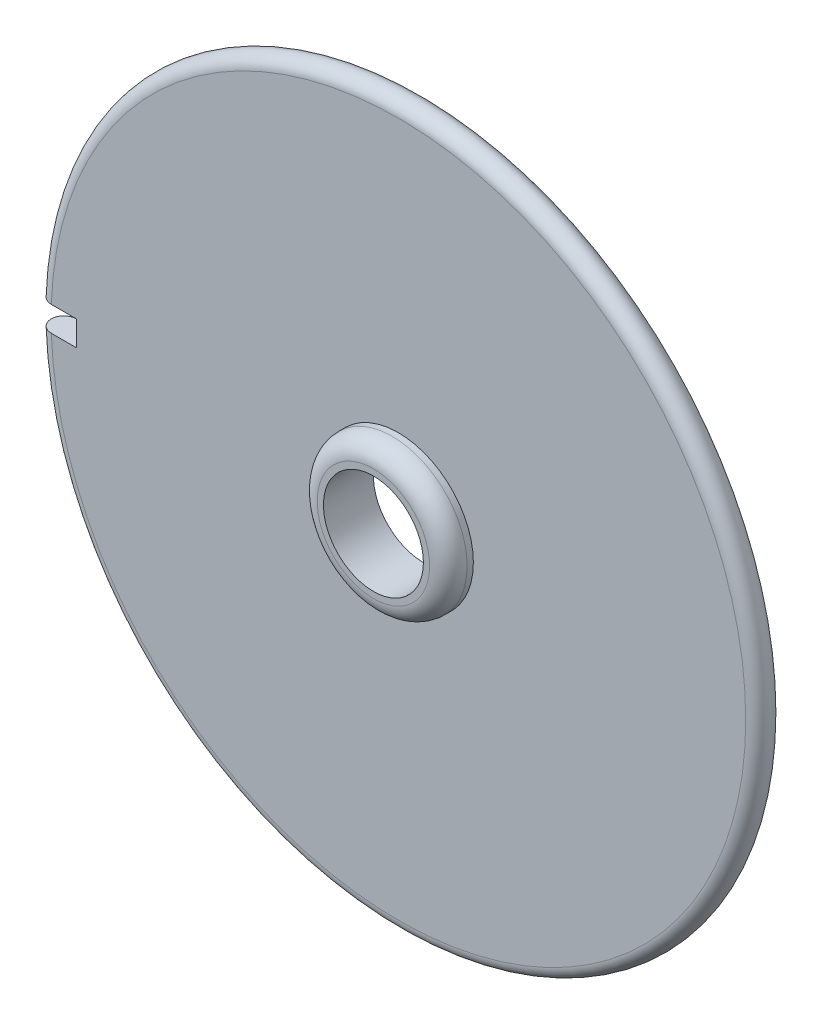
ISO-10303-21;
HEADER;
FILE_DESCRIPTION(('STEP AP214'),'2;1');
FILE_NAME('part.step','',(''),(''),'','','');
FILE_SCHEMA(('AUTOMOTIVE_DESIGN { 1 0 10303 214 1 1 1 1 }'));
ENDSEC;
DATA;
#1=APPLICATION_CONTEXT('core data for automotive mechanical design processes');
#2=APPLICATION_PROTOCOL_DEFINITION('international standard','automotive_design',2000,#1);
#3=PRODUCT_CONTEXT('',#1,'mechanical');
#4=PRODUCT('Part','Part','',(#3));
#5=PRODUCT_RELATED_PRODUCT_CATEGORY('part','',(#4));
#6=PRODUCT_DEFINITION_FORMATION('','',#4);
#7=PRODUCT_DEFINITION_CONTEXT('part definition',#1,'design');
#8=PRODUCT_DEFINITION('design','',#6,#7);
#9=PRODUCT_DEFINITION_SHAPE('','',#8);
#10=(LENGTH_UNIT() NAMED_UNIT(*) SI_UNIT(.MILLI.,.METRE.));
#11=(NAMED_UNIT(*) PLANE_ANGLE_UNIT() SI_UNIT($,.RADIAN.));
#12=(NAMED_UNIT(*) SI_UNIT($,.STERADIAN.) SOLID_ANGLE_UNIT());
#13=UNCERTAINTY_MEASURE_WITH_UNIT(LENGTH_MEASURE(1.E-05),#10,'distance_accuracy_value','');
#14=(GEOMETRIC_REPRESENTATION_CONTEXT(3) GLOBAL_UNCERTAINTY_ASSIGNED_CONTEXT((#13)) GLOBAL_UNIT_ASSIGNED_CONTEXT((#10,
#11,#12)) REPRESENTATION_CONTEXT('',''));
#15=CARTESIAN_POINT('',(0.,0.,0.));
#16=DIRECTION('',(0.,0.,1.));
#17=DIRECTION('',(1.,0.,0.));
#18=AXIS2_PLACEMENT_3D('',#15,#16,#17);
#19=CARTESIAN_POINT('',(0.,-108.5,-3.));
#20=DIRECTION('',(0.,0.,-1.));
#21=DIRECTION('',(-1.,0.,0.));
#22=AXIS2_PLACEMENT_3D('',#19,#20,#21);
#23=TOROIDAL_SURFACE('',#22,27.8,1.);
#24=CARTESIAN_POINT('',(-28.5706549350069,-107.5,-3.61548313948719));
#25=CARTESIAN_POINT('',(-28.5360493688811,-107.5,-3.65976573047431));
#26=CARTESIAN_POINT('',(-28.4976770809783,-107.5,-3.70115691997274));
#27=CARTESIAN_POINT('',(-28.414494288392,-107.5,-3.77694195071759));
#28=CARTESIAN_POINT('',(-28.3696760402174,-107.5,-3.81132725402422));
#29=CARTESIAN_POINT('',(-28.274921163175,-107.5,-3.87207073497879));
#30=CARTESIAN_POINT('',(-28.2249871185362,-107.5,-3.89843293900815));
#31=CARTESIAN_POINT('',(-28.121416937056,-107.5,-3.94239616000779));
#32=CARTESIAN_POINT('',(-28.067781723052,-107.5,-3.95999935199784));
#33=CARTESIAN_POINT('',(-27.958289722152,-107.5,-3.98596564886151));
#34=CARTESIAN_POINT('',(-27.9024318005343,-107.5,-3.99432396974761));
#35=CARTESIAN_POINT('',(-27.7901032671222,-107.5,-4.00154788560054));
#36=CARTESIAN_POINT('',(-27.7336326298471,-107.5,-4.0004130842605));
#37=CARTESIAN_POINT('',(-27.6216652982511,-107.5,-3.98868039625517));
#38=CARTESIAN_POINT('',(-27.5661689113499,-107.5,-3.97807957548041));
#39=CARTESIAN_POINT('',(-27.4577438079127,-107.5,-3.94771074997229));
#40=CARTESIAN_POINT('',(-27.4048150870034,-107.5,-3.92794276085289));
#41=CARTESIAN_POINT('',(-27.3030324566272,-107.5,-3.87980084420323));
#42=CARTESIAN_POINT('',(-27.2541782570571,-107.5,-3.85142753003439));
#43=CARTESIAN_POINT('',(-27.1619297225994,-107.5,-3.78687814909789));
#44=CARTESIAN_POINT('',(-27.1185353665505,-107.5,-3.75070211257361));
#45=CARTESIAN_POINT('',(-27.0384604692737,-107.5,-3.67159150479941));
#46=CARTESIAN_POINT('',(-27.0017768182061,-107.5,-3.62866008134109));
#47=CARTESIAN_POINT('',(-26.9361434204875,-107.5,-3.53724441411334));
#48=CARTESIAN_POINT('',(-26.9071936543983,-107.5,-3.48876018430066));
#49=CARTESIAN_POINT('',(-26.8578701116504,-107.5,-3.38764962878925));
#50=CARTESIAN_POINT('',(-26.8374906753053,-107.5,-3.33502606397631));
#51=CARTESIAN_POINT('',(-26.8058613520361,-107.5,-3.22710334010095));
#52=CARTESIAN_POINT('',(-26.794611429933,-107.5,-3.17180419134929));
#53=CARTESIAN_POINT('',(-26.781565758795,-107.5,-3.06013281543939));
#54=CARTESIAN_POINT('',(-26.7797647893586,-107.5,-3.00376119808603));
#55=CARTESIAN_POINT('',(-26.7856542888168,-107.5,-2.89151604050499));
#56=CARTESIAN_POINT('',(-26.793344743289,-107.5,-2.8356424995206));
#57=CARTESIAN_POINT('',(-26.8179955436472,-107.5,-2.7259897655739));
#58=CARTESIAN_POINT('',(-26.8349542365591,-107.5,-2.67221020098621));
#59=CARTESIAN_POINT('',(-26.8776572475557,-107.5,-2.56826034266674));
#60=CARTESIAN_POINT('',(-26.9034015734532,-107.5,-2.51809005214468));
#61=CARTESIAN_POINT('',(-26.9629516734849,-107.5,-2.42276695244971));
#62=CARTESIAN_POINT('',(-26.9967597298722,-107.5,-2.37761556907629));
#63=CARTESIAN_POINT('',(-27.0714720311697,-107.5,-2.2936251958039));
#64=CARTESIAN_POINT('',(-27.112376297883,-107.5,-2.25478622530036));
#65=CARTESIAN_POINT('',(-27.2001461710862,-107.5,-2.18449780324466));
#66=CARTESIAN_POINT('',(-27.2470153763055,-107.5,-2.15305284548726));
#67=CARTESIAN_POINT('',(-27.3453650217328,-107.5,-2.0984720082762));
#68=CARTESIAN_POINT('',(-27.3968454781676,-107.5,-2.07533615806337));
#69=CARTESIAN_POINT('',(-27.502991703413,-107.5,-2.03801530904375));
#70=CARTESIAN_POINT('',(-27.5576594892603,-107.5,-2.02383604688486));
#71=CARTESIAN_POINT('',(-27.6685993484484,-107.5,-2.00485275303262));
#72=CARTESIAN_POINT('',(-27.7248714266186,-107.5,-2.00004874956444));
#73=CARTESIAN_POINT('',(-27.8374455102165,-107.5,-1.99995197205348));
#74=CARTESIAN_POINT('',(-27.8937475188314,-107.5,-2.00466285602603));
#75=CARTESIAN_POINT('',(-28.004761491413,-107.5,-2.02347023920309));
#76=CARTESIAN_POINT('',(-28.0594734562988,-107.5,-2.03756673298176));
#77=CARTESIAN_POINT('',(-28.1657521242456,-107.5,-2.07474620434655));
#78=CARTESIAN_POINT('',(-28.2173189136175,-107.5,-2.09782893520113));
#79=CARTESIAN_POINT('',(-28.3158432455432,-107.5,-2.15232752212586));
#80=CARTESIAN_POINT('',(-28.3628007877277,-107.5,-2.18374337886372));
#81=CARTESIAN_POINT('',(-28.450752566003,-107.5,-2.25400340174858));
#82=CARTESIAN_POINT('',(-28.4917492196706,-107.5,-2.29284454152116));
#83=CARTESIAN_POINT('',(-28.5666350876387,-107.5,-2.37686200098473));
#84=CARTESIAN_POINT('',(-28.600524309736,-107.5,-2.42203831372601));
#85=CARTESIAN_POINT('',(-28.660212330236,-107.5,-2.51741573600194));
#86=CARTESIAN_POINT('',(-28.6860157783138,-107.5,-2.56761393573902));
#87=CARTESIAN_POINT('',(-28.7288226137204,-107.5,-2.67162961990092));
#88=CARTESIAN_POINT('',(-28.7458263746772,-107.5,-2.72544695055059));
#89=CARTESIAN_POINT('',(-28.770542975914,-107.5,-2.83513792032798));
#90=CARTESIAN_POINT('',(-28.7782617385715,-107.5,-2.89101022523713));
#91=CARTESIAN_POINT('',(-28.784207910326,-107.5,-3.0032728780715));
#92=CARTESIAN_POINT('',(-28.7824329756082,-107.5,-3.05966335049192));
#93=CARTESIAN_POINT('',(-28.7694393541802,-107.5,-3.17135262326791));
#94=CARTESIAN_POINT('',(-28.7582185956437,-107.5,-3.22665118140179));
#95=CARTESIAN_POINT('',(-28.7266550265026,-107.5,-3.33453080919582));
#96=CARTESIAN_POINT('',(-28.7063232160947,-107.5,-3.38711507082725));
#97=CARTESIAN_POINT('',(-28.6664132177166,-107.5,-3.46908344745637));
#98=CARTESIAN_POINT('',(-28.6494258852118,-107.5,-3.49975690396036));
#99=CARTESIAN_POINT('',(-28.612331831085,-107.5,-3.55915574416864));
#100=CARTESIAN_POINT('',(-28.5922251098448,-107.5,-3.58788112811136));
#101=CARTESIAN_POINT('',(-28.5706549350069,-107.5,-3.61548313948719));
#102=B_SPLINE_CURVE_WITH_KNOTS('',3,(#24,#25,#26,#27,#28,#29,#30,#31,#32,#33,#34,#35,#36,#37,
#38,#39,#40,#41,#42,#43,#44,#45,#46,#47,#48,#49,#50,#51,#52,#53,#54,#55,#56,#57,#58,#59,#60,#61,
#62,#63,#64,#65,#66,#67,#68,#69,#70,#71,#72,#73,#74,#75,#76,#77,#78,#79,#80,#81,#82,#83,#84,#85,
#86,#87,#88,#89,#90,#91,#92,#93,#94,#95,#96,#97,#98,#99,#100,#101),.UNSPECIFIED.,.T.,.F.,(4,2,2,
2,2,2,2,2,2,2,2,2,2,2,2,2,2,2,2,2,2,2,2,2,2,2,2,2,2,2,2,2,2,2,2,2,2,2,4),(0.,0.168473455974401,
0.337151015195779,0.505743783695443,0.674294666668594,0.842932729723495,1.01157783290224,
1.18027522786283,1.34897233549123,1.51765742172736,1.68634185415127,1.85494791659102,
2.02355355525522,2.19204767437568,2.36054114423095,2.52894151421762,2.69734162831749,
2.86571171834919,3.03408195810992,3.20249990785057,3.37091837506013,3.53943893745122,
3.70796009288226,3.87658907607993,4.04521856695157,4.21391290006971,4.38260713566542,
4.55129673981728,4.71998635748573,4.88860736717105,5.05722819188001,5.22575187351649,
5.39426839917969,5.56267738055008,5.73112794084096,5.89961545833964,6.0679000988189,
6.17291217498284,6.27792423829423),.UNSPECIFIED.);
#103=CARTESIAN_POINT('',(-27.7820085666965,-107.5,-2.));
#104=VERTEX_POINT('',#103);
#105=CARTESIAN_POINT('',(-27.7820085666965,-107.5,-4.));
#106=VERTEX_POINT('',#105);
#107=EDGE_CURVE('E111',#104,#106,#102,.T.);
#108=ORIENTED_EDGE('',*,*,#107,.F.);
#109=CARTESIAN_POINT('',(0.,-108.5,-2.));
#110=DIRECTION('',(0.,0.,-1.));
#111=DIRECTION('',(-1.,0.,0.));
#112=AXIS2_PLACEMENT_3D('',#109,#110,#111);
#113=CIRCLE('',#112,27.8);
#114=CARTESIAN_POINT('',(-27.7820085666965,-109.5,-2.));
#115=VERTEX_POINT('',#114);
#116=EDGE_CURVE('E153',#115,#104,#113,.F.);
#117=ORIENTED_EDGE('',*,*,#116,.F.);
#118=CARTESIAN_POINT('',(-28.5706549350069,-109.5,-3.61548313948719));
#119=CARTESIAN_POINT('',(-28.6052277086239,-109.5,-3.57123441759007));
#120=CARTESIAN_POINT('',(-28.6360901886805,-109.5,-3.52403498809039));
#121=CARTESIAN_POINT('',(-28.6894781827197,-109.5,-3.42508521699582));
#122=CARTESIAN_POINT('',(-28.7119936701567,-109.5,-3.37332949401606));
#123=CARTESIAN_POINT('',(-28.748004492049,-109.5,-3.26679080388397));
#124=CARTESIAN_POINT('',(-28.7615039666122,-109.5,-3.21200923871274));
#125=CARTESIAN_POINT('',(-28.7791073585726,-109.5,-3.10097197983102));
#126=CARTESIAN_POINT('',(-28.7832136035537,-109.5,-3.04471665480443));
#127=CARTESIAN_POINT('',(-28.7819218274385,-109.5,-2.93232328624461));
#128=CARTESIAN_POINT('',(-28.7765252134605,-109.5,-2.87618522657984));
#129=CARTESIAN_POINT('',(-28.7563834327093,-109.5,-2.7656099067875));
#130=CARTESIAN_POINT('',(-28.741637907136,-109.5,-2.71117271202125));
#131=CARTESIAN_POINT('',(-28.7032183859898,-109.5,-2.60554717173948));
#132=CARTESIAN_POINT('',(-28.6795445650917,-109.5,-2.55435876268702));
#133=CARTESIAN_POINT('',(-28.6239421374292,-109.5,-2.45668116109887));
#134=CARTESIAN_POINT('',(-28.5920135352983,-109.5,-2.41019196592544));
#135=CARTESIAN_POINT('',(-28.5207963095476,-109.5,-2.32321382277761));
#136=CARTESIAN_POINT('',(-28.4815050362239,-109.5,-2.28272704439911));
#137=CARTESIAN_POINT('',(-28.3966865615817,-109.5,-2.20892001442767));
#138=CARTESIAN_POINT('',(-28.3511593530378,-109.5,-2.17559977113846));
#139=CARTESIAN_POINT('',(-28.2551332516543,-109.5,-2.11705092708132));
#140=CARTESIAN_POINT('',(-28.2046314990809,-109.5,-2.09182701658011));
#141=CARTESIAN_POINT('',(-28.1001116749658,-109.5,-2.05021024125079));
#142=CARTESIAN_POINT('',(-28.0460935881294,-109.5,-2.03381741483764));
#143=CARTESIAN_POINT('',(-27.9360419385396,-109.5,-2.01031921279453));
#144=CARTESIAN_POINT('',(-27.8800072589824,-109.5,-2.00321906744836));
#145=CARTESIAN_POINT('',(-27.7675410583925,-109.5,-1.9985238029251));
#146=CARTESIAN_POINT('',(-27.7111095366253,-109.5,-2.00092870134418));
#147=CARTESIAN_POINT('',(-27.5994333896846,-109.5,-2.01517756637605));
#148=CARTESIAN_POINT('',(-27.5441891323397,-109.5,-2.02702441612865));
#149=CARTESIAN_POINT('',(-27.4364738971044,-109.5,-2.05982556836778));
#150=CARTESIAN_POINT('',(-27.3840029199416,-109.5,-2.08077987324425));
#151=CARTESIAN_POINT('',(-27.2833302136961,-109.5,-2.13120021067884));
#152=CARTESIAN_POINT('',(-27.2351280504821,-109.5,-2.16066537639485));
#153=CARTESIAN_POINT('',(-27.144357775773,-109.5,-2.22727364236293));
#154=CARTESIAN_POINT('',(-27.1017896516546,-109.5,-2.26441672541174));
#155=CARTESIAN_POINT('',(-27.0235185791041,-109.5,-2.34530773627051));
#156=CARTESIAN_POINT('',(-26.9878123044454,-109.5,-2.38905244554194));
#157=CARTESIAN_POINT('',(-26.9242564706785,-109.5,-2.48191889290883));
#158=CARTESIAN_POINT('',(-26.8964068834469,-109.5,-2.53104061175614));
#159=CARTESIAN_POINT('',(-26.8493744434141,-109.5,-2.63323169399726));
#160=CARTESIAN_POINT('',(-26.8301858503404,-109.5,-2.6862984155022));
#161=CARTESIAN_POINT('',(-26.8009955544703,-109.5,-2.79490109109811));
#162=CARTESIAN_POINT('',(-26.7909938194892,-109.5,-2.85043703653787));
#163=CARTESIAN_POINT('',(-26.7804654534509,-109.5,-2.96236985133112));
#164=CARTESIAN_POINT('',(-26.7799337582676,-109.5,-3.01876624440768));
#165=CARTESIAN_POINT('',(-26.788347638074,-109.5,-3.13084752804235));
#166=CARTESIAN_POINT('',(-26.7972932027804,-109.5,-3.18653241937242));
#167=CARTESIAN_POINT('',(-26.8244045002478,-109.5,-3.29560168410799));
#168=CARTESIAN_POINT('',(-26.8425688745164,-109.5,-3.34898639521303));
#169=CARTESIAN_POINT('',(-26.8875996014604,-109.5,-3.45194987223139));
#170=CARTESIAN_POINT('',(-26.9144659545612,-109.5,-3.50152863795865));
#171=CARTESIAN_POINT('',(-26.9761458184288,-109.5,-3.59549015477566));
#172=CARTESIAN_POINT('',(-27.0109617994161,-109.5,-3.63987128428377));
#173=CARTESIAN_POINT('',(-27.0875464070111,-109.5,-3.72216313468726));
#174=CARTESIAN_POINT('',(-27.1293150678434,-109.5,-3.76007382373017));
#175=CARTESIAN_POINT('',(-27.218646669147,-109.5,-3.82837368289153));
#176=CARTESIAN_POINT('',(-27.2662131652104,-109.5,-3.85875820251565));
#177=CARTESIAN_POINT('',(-27.3657697399824,-109.5,-3.91111619088226));
#178=CARTESIAN_POINT('',(-27.4177598435964,-109.5,-3.9330896122654));
#179=CARTESIAN_POINT('',(-27.524723986212,-109.5,-3.96801581627092));
#180=CARTESIAN_POINT('',(-27.5796999418069,-109.5,-3.98096272929367));
#181=CARTESIAN_POINT('',(-27.6910428600588,-109.5,-3.99744623925574));
#182=CARTESIAN_POINT('',(-27.7474097715697,-109.5,-4.00098318168556));
#183=CARTESIAN_POINT('',(-27.8599519299441,-109.5,-3.99854768273732));
#184=CARTESIAN_POINT('',(-27.9161271242709,-109.5,-3.99257281636754));
#185=CARTESIAN_POINT('',(-28.0266921670712,-109.5,-3.97127375012708));
#186=CARTESIAN_POINT('',(-28.081081568069,-109.5,-3.95594722552149));
#187=CARTESIAN_POINT('',(-28.1865323606914,-109.5,-3.91637328902175));
#188=CARTESIAN_POINT('',(-28.237592338278,-109.5,-3.89212211542173));
#189=CARTESIAN_POINT('',(-28.3348664228873,-109.5,-3.83540152740591));
#190=CARTESIAN_POINT('',(-28.3810862920649,-109.5,-3.80294204596347));
#191=CARTESIAN_POINT('',(-28.4512099605455,-109.5,-3.74429500502142));
#192=CARTESIAN_POINT('',(-28.4769889690203,-109.5,-3.72031078367927));
#193=CARTESIAN_POINT('',(-28.5258823251779,-109.5,-3.66976475134402));
#194=CARTESIAN_POINT('',(-28.548996673099,-109.5,-3.64320294058127));
#195=CARTESIAN_POINT('',(-28.5706549350069,-109.5,-3.61548313948719));
#196=B_SPLINE_CURVE_WITH_KNOTS('',3,(#118,#119,#120,#121,#122,#123,#124,#125,#126,#127,#128,
#129,#130,#131,#132,#133,#134,#135,#136,#137,#138,#139,#140,#141,#142,#143,#144,#145,#146,#147,
#148,#149,#150,#151,#152,#153,#154,#155,#156,#157,#158,#159,#160,#161,#162,#163,#164,#165,#166,
#167,#168,#169,#170,#171,#172,#173,#174,#175,#176,#177,#178,#179,#180,#181,#182,#183,#184,#185,
#186,#187,#188,#189,#190,#191,#192,#193,#194,#195),.UNSPECIFIED.,.T.,.F.,(4,2,2,2,2,2,2,2,2,2,2,
2,2,2,2,2,2,2,2,2,2,2,2,2,2,2,2,2,2,2,2,2,2,2,2,2,2,2,4),(0.,0.168332457594949,
0.336866468725274,0.505323036576283,0.673737857413537,0.842127742635852,1.0105240908529,
1.17891714470445,1.34731010403384,1.51576378200367,1.68421765515682,1.85276893951852,
2.02132095706715,2.18996780153402,2.35861495820769,2.52731363174364,2.69601234954871,
2.86469389122767,3.03337505496024,3.20197424444927,3.37057283042091,3.5390595091424,
3.70754559759814,3.8759415850146,4.04433738971328,4.21270838665276,4.38107939182279,
4.54950278697583,4.71792701121439,4.88645504827156,5.05498403422536,5.22362250629929,
5.39225478666518,5.56093006593781,5.72964729340296,5.89843571614493,6.06702085529299,
6.17247345277294,6.27792604082867),.UNSPECIFIED.);
#197=CARTESIAN_POINT('',(-27.7820085666965,-109.5,-4.));
#198=VERTEX_POINT('',#197);
#199=EDGE_CURVE('E56',#198,#115,#196,.T.);
#200=ORIENTED_EDGE('',*,*,#199,.F.);
#201=CARTESIAN_POINT('',(0.,-108.5,-4.));
#202=DIRECTION('',(0.,0.,-1.));
#203=DIRECTION('',(-1.,0.,0.));
#204=AXIS2_PLACEMENT_3D('',#201,#202,#203);
#205=CIRCLE('',#204,27.8);
#206=EDGE_CURVE('E101',#106,#198,#205,.T.);
#207=ORIENTED_EDGE('',*,*,#206,.F.);
#208=EDGE_LOOP('',(#108,#117,#200,#207));
#209=FACE_BOUND('',#208,.T.);
#210=ADVANCED_FACE('F40',(#209),#23,.T.);
#211=CARTESIAN_POINT('',(0.,-108.5,-2.));
#212=DIRECTION('',(0.,0.,1.));
#213=DIRECTION('',(1.,0.,0.));
#214=AXIS2_PLACEMENT_3D('',#211,#212,#213);
#215=CYLINDRICAL_SURFACE('',#214,6.);
#216=CARTESIAN_POINT('',(0.,-108.5,-1.5));
#217=DIRECTION('',(0.,0.,1.));
#218=DIRECTION('',(1.,0.,0.));
#219=AXIS2_PLACEMENT_3D('',#216,#217,#218);
#220=CIRCLE('',#219,6.);
#221=CARTESIAN_POINT('',(6.00000000000002,-108.5,-1.5));
#222=VERTEX_POINT('',#221);
#223=EDGE_CURVE('E157',#222,#222,#220,.F.);
#224=ORIENTED_EDGE('',*,*,#223,.T.);
#225=EDGE_LOOP('',(#224));
#226=FACE_BOUND('',#225,.T.);
#227=CARTESIAN_POINT('',(0.,-108.5,-2.));
#228=DIRECTION('',(0.,0.,1.));
#229=DIRECTION('',(1.,0.,0.));
#230=AXIS2_PLACEMENT_3D('',#227,#228,#229);
#231=CIRCLE('',#230,6.);
#232=CARTESIAN_POINT('',(6.00000000000002,-108.5,-2.));
#233=VERTEX_POINT('',#232);
#234=EDGE_CURVE('E228',#233,#233,#231,.T.);
#235=ORIENTED_EDGE('',*,*,#234,.T.);
#236=EDGE_LOOP('',(#235));
#237=FACE_BOUND('',#236,.T.);
#238=ADVANCED_FACE('F136',(#226,#237),#215,.T.);
#239=CARTESIAN_POINT('',(0.,-108.5,0.));
#240=DIRECTION('',(0.,0.,1.));
#241=DIRECTION('',(1.,0.,0.));
#242=AXIS2_PLACEMENT_3D('',#239,#240,#241);
#243=PLANE('',#242);
#244=CARTESIAN_POINT('',(0.,-108.5,0.));
#245=DIRECTION('',(0.,0.,1.));
#246=DIRECTION('',(1.,0.,0.));
#247=AXIS2_PLACEMENT_3D('',#244,#245,#246);
#248=CIRCLE('',#247,4.5);
#249=CARTESIAN_POINT('',(4.50000000000002,-108.5,0.));
#250=VERTEX_POINT('',#249);
#251=EDGE_CURVE('E162',#250,#250,#248,.T.);
#252=ORIENTED_EDGE('',*,*,#251,.T.);
#253=EDGE_LOOP('',(#252));
#254=FACE_BOUND('',#253,.T.);
#255=CARTESIAN_POINT('',(0.,-108.5,0.));
#256=DIRECTION('',(0.,0.,1.));
#257=DIRECTION('',(1.,0.,0.));
#258=AXIS2_PLACEMENT_3D('',#255,#256,#257);
#259=CIRCLE('',#258,4.);
#260=CARTESIAN_POINT('',(4.00000000000002,-108.5,0.));
#261=VERTEX_POINT('',#260);
#262=EDGE_CURVE('E154',#261,#261,#259,.T.);
#263=ORIENTED_EDGE('',*,*,#262,.F.);
#264=EDGE_LOOP('',(#263));
#265=FACE_BOUND('',#264,.T.);
#266=ADVANCED_FACE('F130',(#254,#265),#243,.T.);
#267=CARTESIAN_POINT('',(0.,-108.5,-4.));
#268=DIRECTION('',(0.,0.,-1.));
#269=DIRECTION('',(-1.,0.,0.));
#270=AXIS2_PLACEMENT_3D('',#267,#268,#269);
#271=PLANE('',#270);
#272=DIRECTION('',(-1.,0.,0.));
#273=VECTOR('',#272,1.);
#274=CARTESIAN_POINT('',(-31.7826336529512,-107.5,-4.));
#275=LINE('',#274,#273);
#276=CARTESIAN_POINT('',(-25.7826336529512,-107.5,-4.));
#277=VERTEX_POINT('',#276);
#278=EDGE_CURVE('E88',#277,#106,#275,.T.);
#279=ORIENTED_EDGE('',*,*,#278,.T.);
#280=ORIENTED_EDGE('',*,*,#206,.T.);
#281=DIRECTION('',(1.,0.,0.));
#282=VECTOR('',#281,1.);
#283=CARTESIAN_POINT('',(-31.7826336529512,-109.5,-4.));
#284=LINE('',#283,#282);
#285=CARTESIAN_POINT('',(-25.7826336529512,-109.5,-4.));
#286=VERTEX_POINT('',#285);
#287=EDGE_CURVE('E83',#198,#286,#284,.T.);
#288=ORIENTED_EDGE('',*,*,#287,.T.);
#289=DIRECTION('',(0.,1.,0.));
#290=VECTOR('',#289,1.);
#291=CARTESIAN_POINT('',(-25.7826336529512,-107.5,-4.));
#292=LINE('',#291,#290);
#293=EDGE_CURVE('E91',#286,#277,#292,.T.);
#294=ORIENTED_EDGE('',*,*,#293,.T.);
#295=EDGE_LOOP('',(#279,#280,#288,#294));
#296=FACE_BOUND('',#295,.T.);
#297=CARTESIAN_POINT('',(0.,-108.5,-4.));
#298=DIRECTION('',(0.,0.,1.));
#299=DIRECTION('',(1.,0.,0.));
#300=AXIS2_PLACEMENT_3D('',#297,#298,#299);
#301=CIRCLE('',#300,4.);
#302=CARTESIAN_POINT('',(4.00000000000002,-108.5,-4.));
#303=VERTEX_POINT('',#302);
#304=EDGE_CURVE('E231',#303,#303,#301,.T.);
#305=ORIENTED_EDGE('',*,*,#304,.T.);
#306=EDGE_LOOP('',(#305));
#307=FACE_BOUND('',#306,.T.);
#308=ADVANCED_FACE('F98',(#296,#307),#271,.T.);
#309=CARTESIAN_POINT('',(0.,-108.5,-2.));
#310=DIRECTION('',(0.,0.,-1.));
#311=DIRECTION('',(-1.,0.,0.));
#312=AXIS2_PLACEMENT_3D('',#309,#310,#311);
#313=PLANE('',#312);
#314=ORIENTED_EDGE('',*,*,#116,.T.);
#315=DIRECTION('',(1.,0.,0.));
#316=VECTOR('',#315,1.);
#317=CARTESIAN_POINT('',(0.,-107.5,-2.));
#318=LINE('',#317,#316);
#319=CARTESIAN_POINT('',(-25.7826336529512,-107.5,-2.));
#320=VERTEX_POINT('',#319);
#321=EDGE_CURVE('E11',#104,#320,#318,.T.);
#322=ORIENTED_EDGE('',*,*,#321,.T.);
#323=DIRECTION('',(0.,-1.,0.));
#324=VECTOR('',#323,1.);
#325=CARTESIAN_POINT('',(-25.7826336529512,-108.5,-2.));
#326=LINE('',#325,#324);
#327=CARTESIAN_POINT('',(-25.7826336529512,-109.5,-2.));
#328=VERTEX_POINT('',#327);
#329=EDGE_CURVE('E49',#320,#328,#326,.T.);
#330=ORIENTED_EDGE('',*,*,#329,.T.);
#331=DIRECTION('',(-1.,0.,0.));
#332=VECTOR('',#331,1.);
#333=CARTESIAN_POINT('',(0.,-109.5,-2.));
#334=LINE('',#333,#332);
#335=EDGE_CURVE('E84',#328,#115,#334,.T.);
#336=ORIENTED_EDGE('',*,*,#335,.T.);
#337=EDGE_LOOP('',(#314,#322,#330,#336));
#338=FACE_BOUND('',#337,.T.);
#339=ORIENTED_EDGE('',*,*,#234,.F.);
#340=EDGE_LOOP('',(#339));
#341=FACE_BOUND('',#340,.T.);
#342=ADVANCED_FACE('F126',(#338,#341),#313,.F.);
#343=CARTESIAN_POINT('',(0.,-108.5,-4.));
#344=DIRECTION('',(0.,0.,1.));
#345=DIRECTION('',(1.,0.,0.));
#346=AXIS2_PLACEMENT_3D('',#343,#344,#345);
#347=CYLINDRICAL_SURFACE('',#346,4.);
#348=ORIENTED_EDGE('',*,*,#304,.F.);
#349=EDGE_LOOP('',(#348));
#350=FACE_BOUND('',#349,.T.);
#351=ORIENTED_EDGE('',*,*,#262,.T.);
#352=EDGE_LOOP('',(#351));
#353=FACE_BOUND('',#352,.T.);
#354=ADVANCED_FACE('F122',(#350,#353),#347,.F.);
#355=CARTESIAN_POINT('',(0.,-108.5,-1.5));
#356=DIRECTION('',(0.,0.,1.));
#357=DIRECTION('',(1.,0.,0.));
#358=AXIS2_PLACEMENT_3D('',#355,#356,#357);
#359=TOROIDAL_SURFACE('',#358,4.5,1.5);
#360=ORIENTED_EDGE('',*,*,#223,.F.);
#361=EDGE_LOOP('',(#360));
#362=FACE_BOUND('',#361,.T.);
#363=ORIENTED_EDGE('',*,*,#251,.F.);
#364=EDGE_LOOP('',(#363));
#365=FACE_BOUND('',#364,.T.);
#366=ADVANCED_FACE('F125',(#362,#365),#359,.T.);
#367=CARTESIAN_POINT('',(-25.7826336529512,-107.5,-4.));
#368=DIRECTION('',(1.,0.,0.));
#369=DIRECTION('',(0.,0.,-1.));
#370=AXIS2_PLACEMENT_3D('',#367,#368,#369);
#371=PLANE('',#370);
#372=DIRECTION('',(0.,0.,1.));
#373=VECTOR('',#372,1.);
#374=CARTESIAN_POINT('',(-25.7826336529512,-107.5,-4.));
#375=LINE('',#374,#373);
#376=EDGE_CURVE('E87',#277,#320,#375,.T.);
#377=ORIENTED_EDGE('',*,*,#376,.F.);
#378=ORIENTED_EDGE('',*,*,#293,.F.);
#379=DIRECTION('',(0.,0.,1.));
#380=VECTOR('',#379,1.);
#381=CARTESIAN_POINT('',(-25.7826336529512,-109.5,-4.));
#382=LINE('',#381,#380);
#383=EDGE_CURVE('E79',#286,#328,#382,.T.);
#384=ORIENTED_EDGE('',*,*,#383,.T.);
#385=ORIENTED_EDGE('',*,*,#329,.F.);
#386=EDGE_LOOP('',(#377,#378,#384,#385));
#387=FACE_BOUND('',#386,.T.);
#388=ADVANCED_FACE('F92',(#387),#371,.F.);
#389=CARTESIAN_POINT('',(-31.7826336529512,-107.5,-4.));
#390=DIRECTION('',(0.,1.,0.));
#391=DIRECTION('',(0.,0.,1.));
#392=AXIS2_PLACEMENT_3D('',#389,#390,#391);
#393=PLANE('',#392);
#394=ORIENTED_EDGE('',*,*,#107,.T.);
#395=ORIENTED_EDGE('',*,*,#278,.F.);
#396=ORIENTED_EDGE('',*,*,#376,.T.);
#397=ORIENTED_EDGE('',*,*,#321,.F.);
#398=EDGE_LOOP('',(#394,#395,#396,#397));
#399=FACE_BOUND('',#398,.T.);
#400=ADVANCED_FACE('F121',(#399),#393,.F.);
#401=CARTESIAN_POINT('',(-31.7826336529512,-109.5,-4.));
#402=DIRECTION('',(0.,-1.,0.));
#403=DIRECTION('',(0.,0.,-1.));
#404=AXIS2_PLACEMENT_3D('',#401,#402,#403);
#405=PLANE('',#404);
#406=ORIENTED_EDGE('',*,*,#199,.T.);
#407=ORIENTED_EDGE('',*,*,#335,.F.);
#408=ORIENTED_EDGE('',*,*,#383,.F.);
#409=ORIENTED_EDGE('',*,*,#287,.F.);
#410=EDGE_LOOP('',(#406,#407,#408,#409));
#411=FACE_BOUND('',#410,.T.);
#412=ADVANCED_FACE('F81',(#411),#405,.F.);
#413=CLOSED_SHELL('',(#210,#238,#266,#308,#342,#354,#366,#388,#400,#412));
#414=MANIFOLD_SOLID_BREP('B2',#413);
#415=ADVANCED_BREP_SHAPE_REPRESENTATION('',(#18,#414),#14);
#416=SHAPE_DEFINITION_REPRESENTATION(#9,#415);
ENDSEC;
END-ISO-10303-21;
